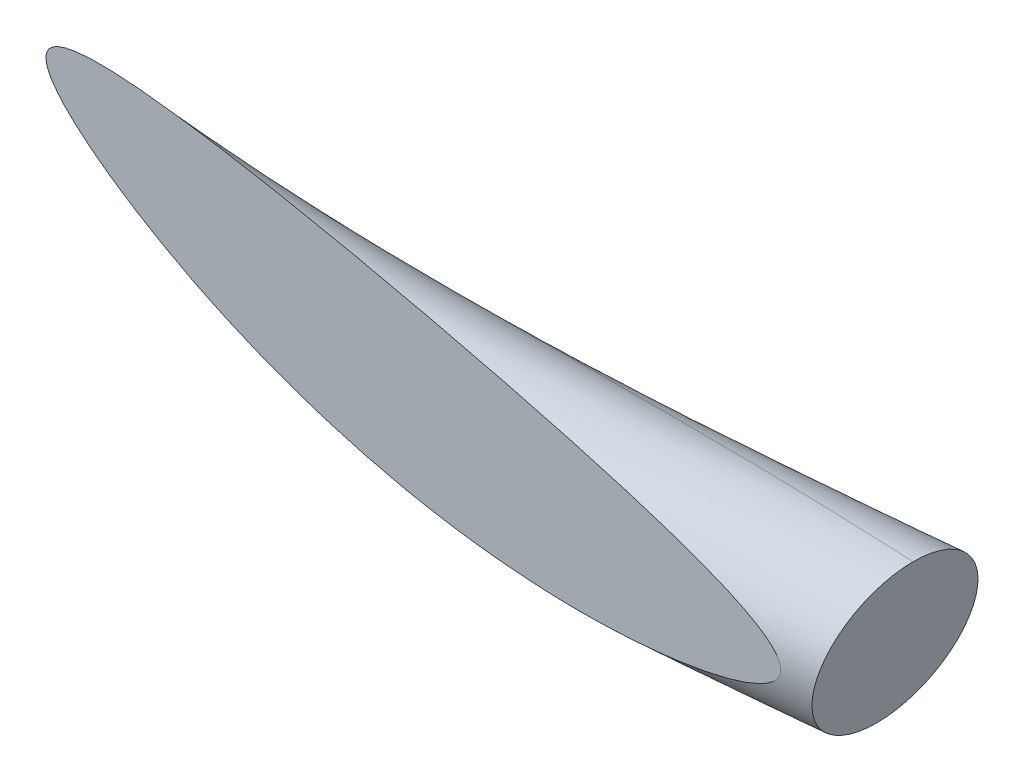
ISO-10303-21;
HEADER;
FILE_DESCRIPTION(('STEP AP214'),'2;1');
FILE_NAME('part.step','',(''),(''),'','','');
FILE_SCHEMA(('AUTOMOTIVE_DESIGN { 1 0 10303 214 1 1 1 1 }'));
ENDSEC;
DATA;
#1=APPLICATION_CONTEXT('core data for automotive mechanical design processes');
#2=APPLICATION_PROTOCOL_DEFINITION('international standard','automotive_design',2000,#1);
#3=PRODUCT_CONTEXT('',#1,'mechanical');
#4=PRODUCT('Part','Part','',(#3));
#5=PRODUCT_RELATED_PRODUCT_CATEGORY('part','',(#4));
#6=PRODUCT_DEFINITION_FORMATION('','',#4);
#7=PRODUCT_DEFINITION_CONTEXT('part definition',#1,'design');
#8=PRODUCT_DEFINITION('design','',#6,#7);
#9=PRODUCT_DEFINITION_SHAPE('','',#8);
#10=(LENGTH_UNIT() NAMED_UNIT(*) SI_UNIT(.MILLI.,.METRE.));
#11=(NAMED_UNIT(*) PLANE_ANGLE_UNIT() SI_UNIT($,.RADIAN.));
#12=(NAMED_UNIT(*) SI_UNIT($,.STERADIAN.) SOLID_ANGLE_UNIT());
#13=UNCERTAINTY_MEASURE_WITH_UNIT(LENGTH_MEASURE(1.E-05),#10,'distance_accuracy_value','');
#14=(GEOMETRIC_REPRESENTATION_CONTEXT(3) GLOBAL_UNCERTAINTY_ASSIGNED_CONTEXT((#13)) GLOBAL_UNIT_ASSIGNED_CONTEXT((#10,
#11,#12)) REPRESENTATION_CONTEXT('',''));
#15=CARTESIAN_POINT('',(0.,0.,0.));
#16=DIRECTION('',(0.,0.,1.));
#17=DIRECTION('',(1.,0.,0.));
#18=AXIS2_PLACEMENT_3D('',#15,#16,#17);
#19=CARTESIAN_POINT('',(20.629091013703,-6.16337401952087,-0.265165042944956));
#20=CARTESIAN_POINT('',(20.3127354136283,-6.14446958063098,-0.262148528351361));
#21=CARTESIAN_POINT('',(19.9975426562461,-6.12052831667255,-0.239177145228182));
#22=CARTESIAN_POINT('',(19.6823498988641,-6.09658705271414,-0.216205762105004));
#23=CARTESIAN_POINT('',(19.3699492837325,-6.06055169196005,-0.176776695296639));
#24=CARTESIAN_POINT('',(19.0575486686009,-6.02451633120597,-0.137347628488274));
#25=CARTESIAN_POINT('',(18.7491444169309,-5.97117081853297,-0.0874635959909151));
#26=CARTESIAN_POINT('',(18.440740165261,-5.91782530585997,-0.0375795634935566));
#27=CARTESIAN_POINT('',(18.1369280881539,-5.84458889985752,0.0151650429449534));
#28=CARTESIAN_POINT('',(17.8331160110468,-5.77135249385508,0.0679096493834633));
#29=CARTESIAN_POINT('',(17.5337928026547,-5.67867266131068,0.115484941563909));
#30=CARTESIAN_POINT('',(17.2344695942626,-5.58599282876628,0.163060233744356));
#31=CARTESIAN_POINT('',(16.9388485591675,-5.47727712190333,0.198223304703362));
#32=CARTESIAN_POINT('',(16.6432275240725,-5.36856141504039,0.233386375662369));
#33=CARTESIAN_POINT('',(16.3499583445323,-5.24965870258173,0.25078396660046));
#34=CARTESIAN_POINT('',(16.0566891649922,-5.13075599012307,0.268181557538551));
#35=CARTESIAN_POINT('',(15.764063474576,-5.00906602004805,0.265165042944956));
#36=CARTESIAN_POINT('',(15.47143778416,-4.88737604997303,0.262148528351361));
#37=CARTESIAN_POINT('',(15.1776492510513,-4.77072290496654,0.239177145228182));
#38=CARTESIAN_POINT('',(14.8838607179426,-4.65406975996004,0.216205762105004));
#39=CARTESIAN_POINT('',(14.5872800425834,-4.5495107117492,0.176776695296639));
#40=CARTESIAN_POINT('',(14.2906993672242,-4.44495166353838,0.137347628488274));
#41=CARTESIAN_POINT('',(13.9901223284034,-4.35770276724646,0.0874635959909153));
#42=CARTESIAN_POINT('',(13.6895452895826,-4.27045387095455,0.0375795634935567));
#43=CARTESIAN_POINT('',(13.3843760761989,-4.20309586799207,-0.0151650429449534));
#44=CARTESIAN_POINT('',(13.0792068628153,-4.1357378650296,-0.0679096493834633));
#45=CARTESIAN_POINT('',(12.7695487807166,-4.08782328860908,-0.115484941563909));
#46=CARTESIAN_POINT('',(12.4598906986179,-4.03990871218857,-0.163060233744356));
#47=CARTESIAN_POINT('',(12.1465304432222,-4.00803001008659,-0.198223304703362));
#48=CARTESIAN_POINT('',(11.8331701878265,-3.97615130798462,-0.233386375662369));
#49=CARTESIAN_POINT('',(11.5174580768759,-3.95445961147836,-0.25078396660046));
#50=CARTESIAN_POINT('',(11.2017459659253,-3.93276791497211,-0.268181557538551));
#51=CARTESIAN_POINT('',(10.8853903658506,-3.91386347608221,-0.265165042944956));
#52=CARTESIAN_POINT('',(20.6290910137029,-6.16337401952086,0.234834957055044));
#53=CARTESIAN_POINT('',(20.3351081870103,-6.04756245248583,0.237851471648639));
#54=CARTESIAN_POINT('',(20.0405851770414,-5.93409067627965,0.222762621027462));
#55=CARTESIAN_POINT('',(19.7460621670725,-5.82061890007347,0.207673770406285));
#56=CARTESIAN_POINT('',(19.4494814917133,-5.71605985186264,0.176776695296637));
#57=CARTESIAN_POINT('',(19.1529008163541,-5.61150080365181,0.14587962018699));
#58=CARTESIAN_POINT('',(18.8530582543935,-5.52107053855957,0.103878120191633));
#59=CARTESIAN_POINT('',(18.5532156924329,-5.43064027346735,0.061876620196276));
#60=CARTESIAN_POINT('',(18.2494036153258,-5.35740386746489,0.0151650429449569));
#61=CARTESIAN_POINT('',(17.9455915382187,-5.28416746146245,-0.0315465343063621));
#62=CARTESIAN_POINT('',(17.6377066401172,-5.22857238133728,-0.0758567746186321));
#63=CARTESIAN_POINT('',(17.3298217420158,-5.17297730121212,-0.120167014930902));
#64=CARTESIAN_POINT('',(17.0183807671483,-5.13278528180592,-0.155330085889909));
#65=CARTESIAN_POINT('',(16.7069397922809,-5.09259326239972,-0.190493156848915));
#66=CARTESIAN_POINT('',(16.3930008653275,-5.06322106218882,-0.211155799655182));
#67=CARTESIAN_POINT('',(16.0790619383742,-5.03384886197791,-0.231818442461448));
#68=CARTESIAN_POINT('',(15.764063474576,-5.00906602004805,-0.234834957055044));
#69=CARTESIAN_POINT('',(15.4490650107779,-4.98428317811817,-0.237851471648639));
#70=CARTESIAN_POINT('',(15.134606730256,-4.95716054535943,-0.222762621027462));
#71=CARTESIAN_POINT('',(14.8201484497342,-4.93003791260069,-0.207673770406285));
#72=CARTESIAN_POINT('',(14.5077478346026,-4.89400255184661,-0.176776695296637));
#73=CARTESIAN_POINT('',(14.195347219471,-4.85796719109252,-0.14587962018699));
#74=CARTESIAN_POINT('',(13.8862084909408,-4.80780304721983,-0.103878120191633));
#75=CARTESIAN_POINT('',(13.5770697624106,-4.75763890334717,-0.061876620196276));
#76=CARTESIAN_POINT('',(13.271900549027,-4.6902809003847,-0.0151650429449569));
#77=CARTESIAN_POINT('',(12.9667313356433,-4.62292289742223,0.0315465343063622));
#78=CARTESIAN_POINT('',(12.665634943254,-4.53792356858247,0.0758567746186323));
#79=CARTESIAN_POINT('',(12.3645385508647,-4.45292423974272,0.120167014930902));
#80=CARTESIAN_POINT('',(12.0669982352414,-4.352521850184,0.155330085889909));
#81=CARTESIAN_POINT('',(11.769457919618,-4.25211946062529,0.190493156848915));
#82=CARTESIAN_POINT('',(11.4744155560806,-4.14089725187127,0.211155799655182));
#83=CARTESIAN_POINT('',(11.1793731925432,-4.02967504311727,0.231818442461448));
#84=CARTESIAN_POINT('',(10.8853903658506,-3.91386347608221,0.234834957055044));
#85=CARTESIAN_POINT('',(20.516615486531,-6.65055905191348,0.23483495705504));
#86=CARTESIAN_POINT('',(20.2226326598384,-6.53474748487845,0.337307655338465));
#87=CARTESIAN_POINT('',(19.9366713395788,-6.38419095625303,0.414104337210003));
#88=CARTESIAN_POINT('',(19.6507100193193,-6.23363442762764,0.490901019081542));
#89=CARTESIAN_POINT('',(19.3699492837325,-6.06055169196006,0.530330085889908));
#90=CARTESIAN_POINT('',(19.0891885481457,-5.88746895629247,0.569759152698275));
#91=CARTESIAN_POINT('',(18.8100157335983,-5.70750817895248,0.565817886447274));
#92=CARTESIAN_POINT('',(18.5308429190509,-5.5275474016125,0.561876620196275));
#93=CARTESIAN_POINT('',(18.2494036153258,-5.35740386746491,0.515165042944956));
#94=CARTESIAN_POINT('',(17.9679643116008,-5.1872603333173,0.468453465693638));
#95=CARTESIAN_POINT('',(17.6807491609125,-5.04213474094438,0.386082991637012));
#96=CARTESIAN_POINT('',(17.3935340102242,-4.89700914857146,0.303712517580386));
#97=CARTESIAN_POINT('',(17.0979129751292,-4.78829344170852,0.198223304703367));
#98=CARTESIAN_POINT('',(16.8022919400341,-4.67957773484557,0.092734091826348));
#99=CARTESIAN_POINT('',(16.4969147027901,-4.61312078221543,-0.0198140834726338));
#100=CARTESIAN_POINT('',(16.1915374655461,-4.5466638295853,-0.132362258771616));
#101=CARTESIAN_POINT('',(15.876539001748,-4.52188098765543,-0.23483495705504));
#102=CARTESIAN_POINT('',(15.5615405379499,-4.49709814572555,-0.337307655338465));
#103=CARTESIAN_POINT('',(15.2385205677186,-4.50706026538605,-0.414104337210003));
#104=CARTESIAN_POINT('',(14.9155005974874,-4.51702238504653,-0.490901019081542));
#105=CARTESIAN_POINT('',(14.5872800425834,-4.54951071174919,-0.530330085889908));
#106=CARTESIAN_POINT('',(14.2590594876794,-4.58199903845187,-0.569759152698275));
#107=CARTESIAN_POINT('',(13.9292510117361,-4.62136540682694,-0.565817886447274));
#108=CARTESIAN_POINT('',(13.5994425357927,-4.660731775202,-0.561876620196275));
#109=CARTESIAN_POINT('',(13.271900549027,-4.69028090038468,-0.515165042944956));
#110=CARTESIAN_POINT('',(12.9443585622613,-4.71983002556736,-0.468453465693638));
#111=CARTESIAN_POINT('',(12.6225924224588,-4.72436120897538,-0.386082991637012));
#112=CARTESIAN_POINT('',(12.3008262826563,-4.72889239238338,-0.303712517580386));
#113=CARTESIAN_POINT('',(11.9874660272606,-4.69701369028141,-0.198223304703367));
#114=CARTESIAN_POINT('',(11.6741057718648,-4.66513498817944,-0.092734091826348));
#115=CARTESIAN_POINT('',(11.3705017186181,-4.59099753184465,0.0198140834726335));
#116=CARTESIAN_POINT('',(11.0668976653713,-4.51686007550988,0.132362258771615));
#117=CARTESIAN_POINT('',(10.7729148386787,-4.40104850847483,0.23483495705504));
#118=CARTESIAN_POINT('',(20.516615486531,-6.65055905191349,-0.265165042944959));
#119=CARTESIAN_POINT('',(20.2002598864563,-6.63165461302359,-0.162692344661536));
#120=CARTESIAN_POINT('',(19.8936288187836,-6.57062859664594,-0.0478354290456411));
#121=CARTESIAN_POINT('',(19.5869977511109,-6.5096025802683,0.0670214865702537));
#122=CARTESIAN_POINT('',(19.2904170757517,-6.40504353205746,0.176776695296632));
#123=CARTESIAN_POINT('',(18.9938364003925,-6.30048448384663,0.286531904023011));
#124=CARTESIAN_POINT('',(18.7061018961358,-6.15760845892587,0.374476170264727));
#125=CARTESIAN_POINT('',(18.418367391879,-6.01473243400512,0.462420436506442));
#126=CARTESIAN_POINT('',(18.1369280881539,-5.84458889985752,0.515165042944953));
#127=CARTESIAN_POINT('',(17.8554887844288,-5.67444536570993,0.567909649383464));
#128=CARTESIAN_POINT('',(17.5768353234499,-5.49223502091778,0.577424707819554));
#129=CARTESIAN_POINT('',(17.298181862471,-5.31002467612562,0.586939766255644));
#130=CARTESIAN_POINT('',(17.0183807671484,-5.13278528180593,0.551776695296638));
#131=CARTESIAN_POINT('',(16.7385796718257,-4.95554588748623,0.516613624337633));
#132=CARTESIAN_POINT('',(16.4538721819949,-4.79955842260835,0.442125682783008));
#133=CARTESIAN_POINT('',(16.1691646921641,-4.64357095773046,0.367637741228384));
#134=CARTESIAN_POINT('',(15.876539001748,-4.52188098765543,0.265165042944959));
#135=CARTESIAN_POINT('',(15.5839133113319,-4.40019101758041,0.162692344661536));
#136=CARTESIAN_POINT('',(15.2815630885138,-4.32062262499314,0.0478354290456411));
#137=CARTESIAN_POINT('',(14.9792128656958,-4.24105423240588,-0.0670214865702536));
#138=CARTESIAN_POINT('',(14.6668122505642,-4.20501887165179,-0.176776695296632));
#139=CARTESIAN_POINT('',(14.3544116354327,-4.16898351089772,-0.286531904023011));
#140=CARTESIAN_POINT('',(14.0331648491986,-4.17126512685355,-0.374476170264727));
#141=CARTESIAN_POINT('',(13.7119180629646,-4.1735467428094,-0.462420436506442));
#142=CARTESIAN_POINT('',(13.3843760761989,-4.20309586799207,-0.515165042944953));
#143=CARTESIAN_POINT('',(13.0568340894332,-4.23264499317476,-0.567909649383464));
#144=CARTESIAN_POINT('',(12.7265062599214,-4.27426092900198,-0.577424707819554));
#145=CARTESIAN_POINT('',(12.3961784304095,-4.31587686482922,-0.586939766255644));
#146=CARTESIAN_POINT('',(12.0669982352414,-4.352521850184,-0.551776695296638));
#147=CARTESIAN_POINT('',(11.7378180400733,-4.38916683553879,-0.516613624337633));
#148=CARTESIAN_POINT('',(11.4135442394133,-4.40455989145175,-0.442125682783009));
#149=CARTESIAN_POINT('',(11.0892704387534,-4.41995294736473,-0.367637741228384));
#150=CARTESIAN_POINT('',(10.7729148386787,-4.40104850847483,-0.265165042944959));
#151=(BOUNDED_SURFACE() B_SPLINE_SURFACE(3,2,((#19,#20,#21,#22,#23,#24,#25,#26,#27,#28,#29,#30,
#31,#32,#33,#34,#35,#36,#37,#38,#39,#40,#41,#42,#43,#44,#45,#46,#47,#48,#49,#50,#51),(#52,#53,
#54,#55,#56,#57,#58,#59,#60,#61,#62,#63,#64,#65,#66,#67,#68,#69,#70,#71,#72,#73,#74,#75,#76,#77,
#78,#79,#80,#81,#82,#83,#84),(#85,#86,#87,#88,#89,#90,#91,#92,#93,#94,#95,#96,#97,#98,#99,#100,
#101,#102,#103,#104,#105,#106,#107,#108,#109,#110,#111,#112,#113,#114,#115,#116,#117),(#118,
#119,#120,#121,#122,#123,#124,#125,#126,#127,#128,#129,#130,#131,#132,#133,#134,#135,#136,#137,
#138,#139,#140,#141,#142,#143,#144,#145,#146,#147,#148,#149,#150)),.UNSPECIFIED.,.F.,.F.,
.F.) B_SPLINE_SURFACE_WITH_KNOTS((4,4),(3,2,2,2,2,2,2,2,2,2,2,2,2,2,2,2,3),(0.5,1.),(0.,0.0625,
0.125,0.1875,0.25,0.3125,0.375,0.4375,0.5,0.5625,0.625,0.6875,0.75,0.8125,0.875,0.9375,1.),
.UNSPECIFIED.) GEOMETRIC_REPRESENTATION_ITEM() RATIONAL_B_SPLINE_SURFACE(((1.,0.98078528040323,
1.,0.98078528040323,1.,0.98078528040323,1.,0.98078528040323,1.,0.98078528040323,1.,
0.98078528040323,1.,0.98078528040323,1.,0.98078528040323,1.,0.98078528040323,1.,
0.98078528040323,1.,0.98078528040323,1.,0.98078528040323,1.,0.98078528040323,1.,
0.98078528040323,1.,0.98078528040323,1.,0.98078528040323,1.),(0.333333333333334,
0.326928426801077,0.333333333333334,0.326928426801077,0.333333333333334,0.326928426801077,
0.333333333333334,0.326928426801077,0.333333333333334,0.326928426801077,0.333333333333334,
0.326928426801077,0.333333333333334,0.326928426801077,0.333333333333334,0.326928426801077,
0.333333333333334,0.326928426801077,0.333333333333334,0.326928426801077,0.333333333333334,
0.326928426801077,0.333333333333334,0.326928426801077,0.333333333333334,0.326928426801077,
0.333333333333334,0.326928426801077,0.333333333333334,0.326928426801077,0.333333333333334,
0.326928426801077,0.333333333333334),(0.333333333333334,0.326928426801077,0.333333333333334,
0.326928426801077,0.333333333333334,0.326928426801077,0.333333333333334,0.326928426801077,
0.333333333333334,0.326928426801077,0.333333333333334,0.326928426801077,0.333333333333334,
0.326928426801077,0.333333333333334,0.326928426801077,0.333333333333334,0.326928426801077,
0.333333333333334,0.326928426801077,0.333333333333334,0.326928426801077,0.333333333333334,
0.326928426801077,0.333333333333334,0.326928426801077,0.333333333333334,0.326928426801077,
0.333333333333334,0.326928426801077,0.333333333333334,0.326928426801077,0.333333333333334),(1.,
0.98078528040323,1.,0.98078528040323,1.,0.98078528040323,1.,0.98078528040323,1.,
0.98078528040323,1.,0.98078528040323,1.,0.98078528040323,1.,0.98078528040323,1.,
0.98078528040323,1.,0.98078528040323,1.,0.98078528040323,1.,0.98078528040323,1.,
0.98078528040323,1.,0.98078528040323,1.,0.98078528040323,1.,0.98078528040323,1.))) REPRESENTATION_ITEM('') SURFACE());
#152=CARTESIAN_POINT('',(19.7657635018325,-6.5431386126793,0.));
#153=CARTESIAN_POINT('',(19.7856712928875,-6.54396982380762,0.));
#154=CARTESIAN_POINT('',(19.8055896295233,-6.54456318798323,0.));
#155=CARTESIAN_POINT('',(19.8454325002929,-6.54525613188267,0.));
#156=CARTESIAN_POINT('',(19.8653570334371,-6.5453557689975,0.));
#157=CARTESIAN_POINT('',(19.9052559509131,-6.54504294716052,0.));
#158=CARTESIAN_POINT('',(19.9252303242374,-6.54462910167178,0.));
#159=CARTESIAN_POINT('',(19.965163530822,-6.54333587178072,0.));
#160=CARTESIAN_POINT('',(19.9851223640899,-6.54245648761099,0.));
#161=CARTESIAN_POINT('',(20.0452606513832,-6.53904351895754,0.));
#162=CARTESIAN_POINT('',(20.0853987595895,-6.53573690529181,0.));
#163=CARTESIAN_POINT('',(20.1653757993071,-6.52669650939841,0.));
#164=CARTESIAN_POINT('',(20.2052150344747,-6.52096567393534,0.));
#165=CARTESIAN_POINT('',(20.2614695555628,-6.51031256374244,0.));
#166=CARTESIAN_POINT('',(20.2781567652978,-6.50682657393397,0.));
#167=CARTESIAN_POINT('',(20.3113415500428,-6.49904366573707,0.));
#168=CARTESIAN_POINT('',(20.3278391945265,-6.49474705518731,0.));
#169=CARTESIAN_POINT('',(20.3592091129596,-6.48542127681081,0.));
#170=CARTESIAN_POINT('',(20.3741066738883,-6.48047701932929,0.));
#171=CARTESIAN_POINT('',(20.4034374775021,-6.46917582609198,0.));
#172=CARTESIAN_POINT('',(20.4178699265963,-6.46281660851198,0.));
#173=CARTESIAN_POINT('',(20.4385586842128,-6.45134082791128,0.));
#174=CARTESIAN_POINT('',(20.445326567518,-6.44716674266135,0.));
#175=CARTESIAN_POINT('',(20.4581461431644,-6.43786911892822,0.));
#176=CARTESIAN_POINT('',(20.4642031331309,-6.43275344528898,0.));
#177=CARTESIAN_POINT('',(20.4734610795265,-6.42257721222107,0.));
#178=CARTESIAN_POINT('',(20.4769960569676,-6.41783958255583,0.));
#179=CARTESIAN_POINT('',(20.4824265981168,-6.40733753939651,0.));
#180=CARTESIAN_POINT('',(20.4843058275141,-6.40156355748327,0.));
#181=CARTESIAN_POINT('',(20.485394337606,-6.39042585224517,0.));
#182=CARTESIAN_POINT('',(20.4848821496545,-6.3850898265047,-2.86986976378911E-13));
#183=CARTESIAN_POINT('',(20.4818804645482,-6.37355886644759,-3.4152470787184E-13));
#184=CARTESIAN_POINT('',(20.4789043871295,-6.36750938767171,0.));
#185=CARTESIAN_POINT('',(20.4720111990254,-6.35684059661074,0.));
#186=CARTESIAN_POINT('',(20.4682027124092,-6.35214161069068,0.));
#187=CARTESIAN_POINT('',(20.4599858103376,-6.34328217462558,0.));
#188=CARTESIAN_POINT('',(20.4555753842175,-6.33912362466881,0.));
#189=CARTESIAN_POINT('',(20.4413965562832,-6.32688132916093,0.));
#190=CARTESIAN_POINT('',(20.43104978107,-6.31948618030233,0.));
#191=CARTESIAN_POINT('',(20.4097354770108,-6.30570906090727,0.));
#192=CARTESIAN_POINT('',(20.3987675053873,-6.29932782571869,-1.58524476480182E-13));
#193=CARTESIAN_POINT('',(20.3763730645553,-6.28717473576867,1.59936639581926E-13));
#194=CARTESIAN_POINT('',(20.3649433813409,-6.28140881585827,5.96282848450191E-13));
#195=CARTESIAN_POINT('',(20.3418728147792,-6.27035658169338,-5.95689520592345E-13));
#196=CARTESIAN_POINT('',(20.330232152902,-6.26506979591893,-2.22195409757902E-12));
#197=CARTESIAN_POINT('',(20.2955157675229,-6.24991612739802,-3.95280876247085E-12));
#198=CARTESIAN_POINT('',(20.2722255143011,-6.24054255775912,-1.08292770119105E-12));
#199=CARTESIAN_POINT('',(20.2253265309996,-6.22262357916096,1.08334865055194E-12));
#200=CARTESIAN_POINT('',(20.2017176806427,-6.21407849353584,3.78354442763802E-13));
#201=CARTESIAN_POINT('',(20.1305376717302,-6.18927369069117,-7.57637616020959E-13));
#202=CARTESIAN_POINT('',(20.082670281603,-6.17386749272624,-2.05507049098778E-13));
#203=CARTESIAN_POINT('',(19.9867793624861,-6.14444872344934,2.04489823335946E-13));
#204=CARTESIAN_POINT('',(19.9387577791497,-6.13042963138194,0.));
#205=CARTESIAN_POINT('',(19.8424752684324,-6.10337185667966,0.));
#206=CARTESIAN_POINT('',(19.7942145288523,-6.09033250489568,0.));
#207=CARTESIAN_POINT('',(19.7032841946373,-6.06645604095859,0.));
#208=CARTESIAN_POINT('',(19.6606346628916,-6.05554181720971,1.77015498307519E-13));
#209=CARTESIAN_POINT('',(19.5752136839694,-6.03416951221614,-1.77046691168191E-13));
#210=CARTESIAN_POINT('',(19.5324422166339,-6.02371151168969,-6.386316027853E-13));
#211=CARTESIAN_POINT('',(19.4039349371476,-5.99296258267913,1.27785763930881E-12));
#212=CARTESIAN_POINT('',(19.3180459164206,-5.97330705186971,6.96067858414691E-12));
#213=CARTESIAN_POINT('',(19.174586420413,-5.94198941820761,5.10978647028664E-12));
#214=CARTESIAN_POINT('',(19.1171201268729,-5.92984687064655,1.35031406880111E-12));
#215=CARTESIAN_POINT('',(19.0020078155184,-5.90646849558197,-1.35015683711631E-12));
#216=CARTESIAN_POINT('',(18.9443618194105,-5.89523256266384,-2.91716357653552E-13));
#217=CARTESIAN_POINT('',(18.8484176896091,-5.87766313655958,1.92898331366684E-13));
#218=CARTESIAN_POINT('',(18.8101876146521,-5.87095927037903,0.));
#219=CARTESIAN_POINT('',(18.7336031174744,-5.85830781865927,0.));
#220=CARTESIAN_POINT('',(18.6952487044339,-5.85236017853307,0.));
#221=CARTESIAN_POINT('',(18.6314160840678,-5.84334734911109,0.));
#222=CARTESIAN_POINT('',(18.6059795088328,-5.83998842474677,0.));
#223=CARTESIAN_POINT('',(18.555031269762,-5.83390402371545,0.));
#224=CARTESIAN_POINT('',(18.529519616548,-5.83117846143011,0.));
#225=CARTESIAN_POINT('',(18.4870196246178,-5.82742522164896,0.));
#226=CARTESIAN_POINT('',(18.4700547769046,-5.82613487260256,0.));
#227=CARTESIAN_POINT('',(18.4361002058719,-5.82412328345056,0.));
#228=CARTESIAN_POINT('',(18.4191105089835,-5.82340163741401,0.));
#229=CARTESIAN_POINT('',(18.390750754166,-5.82289894521078,0.));
#230=CARTESIAN_POINT('',(18.3793853031005,-5.82288535411399,0.));
#231=CARTESIAN_POINT('',(18.3566667993281,-5.82337658616204,0.));
#232=CARTESIAN_POINT('',(18.3453137435033,-5.82388120546118,1.06266371446569E-13));
#233=CARTESIAN_POINT('',(18.3229154925966,-5.82562728229112,-1.02744015324077E-13));
#234=CARTESIAN_POINT('',(18.3118691003632,-5.82685197230025,-3.81117001323292E-13));
#235=CARTESIAN_POINT('',(18.2899763395322,-5.83044592842413,3.79800621359439E-13));
#236=CARTESIAN_POINT('',(18.2791294118372,-5.83281122655674,1.41454333465066E-12));
#237=CARTESIAN_POINT('',(18.2602875659629,-5.83887389202885,1.23853575038291E-12));
#238=CARTESIAN_POINT('',(18.2521795086446,-5.84217729342313,4.61381159329852E-13));
#239=CARTESIAN_POINT('',(18.2390961915436,-5.85002864926089,-3.42583178774712E-13));
#240=CARTESIAN_POINT('',(18.2338482403975,-5.85404754353436,-5.09819885361749E-13));
#241=CARTESIAN_POINT('',(18.2277628434525,-5.86088481859611,2.1035665897194E-13));
#242=CARTESIAN_POINT('',(18.2261466508056,-5.86301922708488,5.35367854953749E-13));
#243=CARTESIAN_POINT('',(18.2247311923683,-5.86530453885813,1.01030413393525E-12));
#244=B_SPLINE_CURVE_WITH_KNOTS('',3,(#152,#153,#154,#155,#156,#157,#158,#159,#160,#161,#162,
#163,#164,#165,#166,#167,#168,#169,#170,#171,#172,#173,#174,#175,#176,#177,#178,#179,#180,#181,
#182,#183,#184,#185,#186,#187,#188,#189,#190,#191,#192,#193,#194,#195,#196,#197,#198,#199,#200,
#201,#202,#203,#204,#205,#206,#207,#208,#209,#210,#211,#212,#213,#214,#215,#216,#217,#218,#219,
#220,#221,#222,#223,#224,#225,#226,#227,#228,#229,#230,#231,#232,#233,#234,#235,#236,#237,#238,
#239,#240,#241,#242,#243),.UNSPECIFIED.,.F.,.F.,(4,2,2,2,2,2,2,2,2,2,2,2,2,2,2,2,2,2,2,2,2,2,2,
2,2,2,2,2,2,2,2,2,2,2,2,2,2,2,2,2,2,2,2,2,2,4),(0.,0.0597749641716232,0.119542979917802,
0.17947273670242,0.239402463544526,0.360170271952191,0.480791700895473,0.531921400133732,
0.583031721467327,0.63009624974173,0.67723723354251,0.701048800270953,0.724669825807787,
0.742227510201339,0.759956525727209,0.775675661641567,0.795547118438668,0.81363250160637,
0.831779845628505,0.869800213951864,0.907848032170209,0.946234786849238,0.984583345006292,
1.05986940265878,1.13518472506995,1.28600024319794,1.43606924955835,1.58603481119131,
1.71810401511269,1.85019649166452,2.11450439550267,2.29070535097367,2.46688578945997,
2.58332099338225,2.69974778783639,2.77671531667302,2.8536724349241,2.90470818946826,
2.95570748244207,2.98979616354018,3.02387144048675,3.05718302079725,3.09037954274841,
3.11646377087487,3.13592419867294,3.14393987694467),.UNSPECIFIED.);
#245=CARTESIAN_POINT('',(19.7657635018325,-6.5431386126793,0.));
#246=VERTEX_POINT('',#245);
#247=CARTESIAN_POINT('',(18.224731192372,-5.86530453886305,0.));
#248=VERTEX_POINT('',#247);
#249=EDGE_CURVE('E11',#246,#248,#244,.T.);
#250=CARTESIAN_POINT('',(20.516615486531,-6.65055905191349,-0.265165042944959));
#251=CARTESIAN_POINT('',(20.2002598864563,-6.63165461302359,-0.162692344661536));
#252=CARTESIAN_POINT('',(19.8936288187836,-6.57062859664594,-0.0478354290456411));
#253=CARTESIAN_POINT('',(19.5869977511109,-6.5096025802683,0.0670214865702537));
#254=CARTESIAN_POINT('',(19.2904170757517,-6.40504353205746,0.176776695296632));
#255=CARTESIAN_POINT('',(18.9938364003925,-6.30048448384663,0.286531904023011));
#256=CARTESIAN_POINT('',(18.7061018961358,-6.15760845892587,0.374476170264727));
#257=CARTESIAN_POINT('',(18.418367391879,-6.01473243400512,0.462420436506442));
#258=CARTESIAN_POINT('',(18.1369280881539,-5.84458889985752,0.515165042944953));
#259=CARTESIAN_POINT('',(17.8554887844288,-5.67444536570993,0.567909649383464));
#260=CARTESIAN_POINT('',(17.5768353234499,-5.49223502091778,0.577424707819554));
#261=CARTESIAN_POINT('',(17.298181862471,-5.31002467612562,0.586939766255644));
#262=CARTESIAN_POINT('',(17.0183807671484,-5.13278528180593,0.551776695296638));
#263=CARTESIAN_POINT('',(16.7385796718257,-4.95554588748623,0.516613624337633));
#264=CARTESIAN_POINT('',(16.4538721819949,-4.79955842260835,0.442125682783008));
#265=CARTESIAN_POINT('',(16.1691646921641,-4.64357095773046,0.367637741228384));
#266=CARTESIAN_POINT('',(15.876539001748,-4.52188098765543,0.265165042944959));
#267=CARTESIAN_POINT('',(15.5839133113319,-4.40019101758041,0.162692344661536));
#268=CARTESIAN_POINT('',(15.2815630885138,-4.32062262499314,0.0478354290456411));
#269=CARTESIAN_POINT('',(14.9792128656958,-4.24105423240588,-0.0670214865702536));
#270=CARTESIAN_POINT('',(14.6668122505642,-4.20501887165179,-0.176776695296632));
#271=CARTESIAN_POINT('',(14.3544116354327,-4.16898351089772,-0.286531904023011));
#272=CARTESIAN_POINT('',(14.0331648491986,-4.17126512685355,-0.374476170264727));
#273=CARTESIAN_POINT('',(13.7119180629646,-4.1735467428094,-0.462420436506442));
#274=CARTESIAN_POINT('',(13.3843760761989,-4.20309586799207,-0.515165042944953));
#275=CARTESIAN_POINT('',(13.0568340894332,-4.23264499317476,-0.567909649383464));
#276=CARTESIAN_POINT('',(12.7265062599214,-4.27426092900198,-0.577424707819554));
#277=CARTESIAN_POINT('',(12.3961784304095,-4.31587686482922,-0.586939766255644));
#278=CARTESIAN_POINT('',(12.0669982352414,-4.352521850184,-0.551776695296638));
#279=CARTESIAN_POINT('',(11.7378180400733,-4.38916683553879,-0.516613624337633));
#280=CARTESIAN_POINT('',(11.4135442394133,-4.40455989145175,-0.442125682783009));
#281=CARTESIAN_POINT('',(11.0892704387534,-4.41995294736473,-0.367637741228384));
#282=CARTESIAN_POINT('',(10.7729148386787,-4.40104850847483,-0.265165042944959));
#283=(BOUNDED_CURVE() B_SPLINE_CURVE(2,(#250,#251,#252,#253,#254,#255,#256,#257,#258,#259,#260,
#261,#262,#263,#264,#265,#266,#267,#268,#269,#270,#271,#272,#273,#274,#275,#276,#277,#278,#279,
#280,#281,#282),.UNSPECIFIED.,.F.,.F.) B_SPLINE_CURVE_WITH_KNOTS((3,2,2,2,2,2,2,2,2,2,2,2,2,2,2,
2,3),(0.,0.0625,0.125,0.1875,0.25,0.3125,0.375,0.4375,0.5,0.5625,0.625,0.6875,0.75,0.8125,0.875,
0.9375,1.),.UNSPECIFIED.) CURVE() GEOMETRIC_REPRESENTATION_ITEM() RATIONAL_B_SPLINE_CURVE((1.,
0.98078528040323,1.,0.98078528040323,1.,0.98078528040323,1.,0.98078528040323,1.,
0.98078528040323,1.,0.98078528040323,1.,0.98078528040323,1.,0.98078528040323,1.,
0.98078528040323,1.,0.98078528040323,1.,0.98078528040323,1.,0.98078528040323,1.,
0.98078528040323,1.,0.98078528040323,1.,0.98078528040323,1.,0.98078528040323,1.)) REPRESENTATION_ITEM(''));
#284=CARTESIAN_POINT('',(20.516615486531,-6.65055905191349,-0.265165042944959));
#285=VERTEX_POINT('',#284);
#286=EDGE_CURVE('E52',#285,#246,#283,.T.);
#287=CARTESIAN_POINT('',(20.572853250117,-6.40696653571718,-0.265165042944958));
#288=DIRECTION('',(0.974370064785235,-0.224951054343864,0.));
#289=DIRECTION('',(-0.224951054343864,-0.974370064785236,0.));
#290=AXIS2_PLACEMENT_3D('',#287,#288,#289);
#291=CIRCLE('',#290,0.25);
#292=CARTESIAN_POINT('',(20.629091013703,-6.16337401952087,-0.265165042944956));
#293=VERTEX_POINT('',#292);
#294=EDGE_CURVE('E82',#293,#285,#291,.T.);
#295=CARTESIAN_POINT('',(20.629091013703,-6.16337401952087,-0.265165042944956));
#296=CARTESIAN_POINT('',(20.3127354136283,-6.14446958063098,-0.262148528351361));
#297=CARTESIAN_POINT('',(19.9975426562461,-6.12052831667255,-0.239177145228182));
#298=CARTESIAN_POINT('',(19.6823498988641,-6.09658705271414,-0.216205762105004));
#299=CARTESIAN_POINT('',(19.3699492837325,-6.06055169196005,-0.176776695296639));
#300=CARTESIAN_POINT('',(19.0575486686009,-6.02451633120597,-0.137347628488274));
#301=CARTESIAN_POINT('',(18.7491444169309,-5.97117081853297,-0.0874635959909151));
#302=CARTESIAN_POINT('',(18.440740165261,-5.91782530585997,-0.0375795634935566));
#303=CARTESIAN_POINT('',(18.1369280881539,-5.84458889985752,0.0151650429449534));
#304=CARTESIAN_POINT('',(17.8331160110468,-5.77135249385508,0.0679096493834633));
#305=CARTESIAN_POINT('',(17.5337928026547,-5.67867266131068,0.115484941563909));
#306=CARTESIAN_POINT('',(17.2344695942626,-5.58599282876628,0.163060233744356));
#307=CARTESIAN_POINT('',(16.9388485591675,-5.47727712190333,0.198223304703362));
#308=CARTESIAN_POINT('',(16.6432275240725,-5.36856141504039,0.233386375662369));
#309=CARTESIAN_POINT('',(16.3499583445323,-5.24965870258173,0.25078396660046));
#310=CARTESIAN_POINT('',(16.0566891649922,-5.13075599012307,0.268181557538551));
#311=CARTESIAN_POINT('',(15.764063474576,-5.00906602004805,0.265165042944956));
#312=CARTESIAN_POINT('',(15.47143778416,-4.88737604997303,0.262148528351361));
#313=CARTESIAN_POINT('',(15.1776492510513,-4.77072290496654,0.239177145228182));
#314=CARTESIAN_POINT('',(14.8838607179426,-4.65406975996004,0.216205762105004));
#315=CARTESIAN_POINT('',(14.5872800425834,-4.5495107117492,0.176776695296639));
#316=CARTESIAN_POINT('',(14.2906993672242,-4.44495166353838,0.137347628488274));
#317=CARTESIAN_POINT('',(13.9901223284034,-4.35770276724646,0.0874635959909153));
#318=CARTESIAN_POINT('',(13.6895452895826,-4.27045387095455,0.0375795634935567));
#319=CARTESIAN_POINT('',(13.3843760761989,-4.20309586799207,-0.0151650429449534));
#320=CARTESIAN_POINT('',(13.0792068628153,-4.1357378650296,-0.0679096493834633));
#321=CARTESIAN_POINT('',(12.7695487807166,-4.08782328860908,-0.115484941563909));
#322=CARTESIAN_POINT('',(12.4598906986179,-4.03990871218857,-0.163060233744356));
#323=CARTESIAN_POINT('',(12.1465304432222,-4.00803001008659,-0.198223304703362));
#324=CARTESIAN_POINT('',(11.8331701878265,-3.97615130798462,-0.233386375662369));
#325=CARTESIAN_POINT('',(11.5174580768759,-3.95445961147836,-0.25078396660046));
#326=CARTESIAN_POINT('',(11.2017459659253,-3.93276791497211,-0.268181557538551));
#327=CARTESIAN_POINT('',(10.8853903658506,-3.91386347608221,-0.265165042944956));
#328=(BOUNDED_CURVE() B_SPLINE_CURVE(2,(#295,#296,#297,#298,#299,#300,#301,#302,#303,#304,#305,
#306,#307,#308,#309,#310,#311,#312,#313,#314,#315,#316,#317,#318,#319,#320,#321,#322,#323,#324,
#325,#326,#327),.UNSPECIFIED.,.F.,.F.) B_SPLINE_CURVE_WITH_KNOTS((3,2,2,2,2,2,2,2,2,2,2,2,2,2,2,
2,3),(0.,0.0625,0.125,0.1875,0.25,0.3125,0.375,0.4375,0.5,0.5625,0.625,0.6875,0.75,0.8125,0.875,
0.9375,1.),.UNSPECIFIED.) CURVE() GEOMETRIC_REPRESENTATION_ITEM() RATIONAL_B_SPLINE_CURVE((1.,
0.98078528040323,1.,0.98078528040323,1.,0.98078528040323,1.,0.98078528040323,1.,
0.98078528040323,1.,0.98078528040323,1.,0.98078528040323,1.,0.98078528040323,1.,
0.98078528040323,1.,0.98078528040323,1.,0.98078528040323,1.,0.98078528040323,1.,
0.98078528040323,1.,0.98078528040323,1.,0.98078528040323,1.,0.98078528040323,1.)) REPRESENTATION_ITEM(''));
#329=EDGE_CURVE('E85',#293,#248,#328,.T.);
#330=ORIENTED_EDGE('',*,*,#249,.F.);
#331=ORIENTED_EDGE('',*,*,#286,.F.);
#332=ORIENTED_EDGE('',*,*,#294,.F.);
#333=ORIENTED_EDGE('',*,*,#329,.T.);
#334=EDGE_LOOP('',(#330,#331,#332,#333));
#335=FACE_BOUND('',#334,.T.);
#336=ADVANCED_FACE('F46',(#335),#151,.F.);
#337=CARTESIAN_POINT('',(20.516615486531,-6.65055905191349,-0.265165042944959));
#338=CARTESIAN_POINT('',(20.2002598864563,-6.63165461302359,-0.162692344661536));
#339=CARTESIAN_POINT('',(19.8936288187836,-6.57062859664594,-0.0478354290456411));
#340=CARTESIAN_POINT('',(19.5869977511109,-6.5096025802683,0.0670214865702537));
#341=CARTESIAN_POINT('',(19.2904170757517,-6.40504353205746,0.176776695296632));
#342=CARTESIAN_POINT('',(18.9938364003925,-6.30048448384663,0.286531904023011));
#343=CARTESIAN_POINT('',(18.7061018961358,-6.15760845892587,0.374476170264727));
#344=CARTESIAN_POINT('',(18.418367391879,-6.01473243400512,0.462420436506442));
#345=CARTESIAN_POINT('',(18.1369280881539,-5.84458889985752,0.515165042944953));
#346=CARTESIAN_POINT('',(17.8554887844288,-5.67444536570993,0.567909649383464));
#347=CARTESIAN_POINT('',(17.5768353234499,-5.49223502091778,0.577424707819554));
#348=CARTESIAN_POINT('',(17.298181862471,-5.31002467612562,0.586939766255644));
#349=CARTESIAN_POINT('',(17.0183807671484,-5.13278528180593,0.551776695296638));
#350=CARTESIAN_POINT('',(16.7385796718257,-4.95554588748623,0.516613624337633));
#351=CARTESIAN_POINT('',(16.4538721819949,-4.79955842260835,0.442125682783008));
#352=CARTESIAN_POINT('',(16.1691646921641,-4.64357095773046,0.367637741228384));
#353=CARTESIAN_POINT('',(15.876539001748,-4.52188098765543,0.265165042944959));
#354=CARTESIAN_POINT('',(15.5839133113319,-4.40019101758041,0.162692344661536));
#355=CARTESIAN_POINT('',(15.2815630885138,-4.32062262499314,0.0478354290456411));
#356=CARTESIAN_POINT('',(14.9792128656958,-4.24105423240588,-0.0670214865702536));
#357=CARTESIAN_POINT('',(14.6668122505642,-4.20501887165179,-0.176776695296632));
#358=CARTESIAN_POINT('',(14.3544116354327,-4.16898351089772,-0.286531904023011));
#359=CARTESIAN_POINT('',(14.0331648491986,-4.17126512685355,-0.374476170264727));
#360=CARTESIAN_POINT('',(13.7119180629646,-4.1735467428094,-0.462420436506442));
#361=CARTESIAN_POINT('',(13.3843760761989,-4.20309586799207,-0.515165042944953));
#362=CARTESIAN_POINT('',(13.0568340894332,-4.23264499317476,-0.567909649383464));
#363=CARTESIAN_POINT('',(12.7265062599214,-4.27426092900198,-0.577424707819554));
#364=CARTESIAN_POINT('',(12.3961784304095,-4.31587686482922,-0.586939766255644));
#365=CARTESIAN_POINT('',(12.0669982352414,-4.352521850184,-0.551776695296638));
#366=CARTESIAN_POINT('',(11.7378180400733,-4.38916683553879,-0.516613624337633));
#367=CARTESIAN_POINT('',(11.4135442394133,-4.40455989145175,-0.442125682783009));
#368=CARTESIAN_POINT('',(11.0892704387534,-4.41995294736473,-0.367637741228384));
#369=CARTESIAN_POINT('',(10.7729148386787,-4.40104850847483,-0.265165042944959));
#370=CARTESIAN_POINT('',(20.516615486531,-6.65055905191348,-0.765165042944959));
#371=CARTESIAN_POINT('',(20.1778871130743,-6.72856174116874,-0.662692344661536));
#372=CARTESIAN_POINT('',(19.8505862979884,-6.75706623703883,-0.509775195301285));
#373=CARTESIAN_POINT('',(19.5232854829025,-6.78557073290894,-0.356858045941035));
#374=CARTESIAN_POINT('',(19.2108848677709,-6.74953537215486,-0.176776695296644));
#375=CARTESIAN_POINT('',(18.8984842526393,-6.71350001140078,0.00330465534774707));
#376=CARTESIAN_POINT('',(18.6021880586732,-6.60770873889925,0.183134454082178));
#377=CARTESIAN_POINT('',(18.305891864707,-6.50191746639773,0.36296425281661));
#378=CARTESIAN_POINT('',(18.024452560982,-6.33177393225013,0.51516504294495));
#379=CARTESIAN_POINT('',(17.7430132572569,-6.16163039810255,0.667365833073289));
#380=CARTESIAN_POINT('',(17.4729214859874,-5.94233530089117,0.768766424002094));
#381=CARTESIAN_POINT('',(17.2028297147178,-5.72304020367978,0.870167014930902));
#382=CARTESIAN_POINT('',(16.9388485591675,-5.47727712190333,0.905330085889909));
#383=CARTESIAN_POINT('',(16.6748674036173,-5.23151404012689,0.940493156848917));
#384=CARTESIAN_POINT('',(16.4108296611997,-4.98599606300125,0.904065449038649));
#385=CARTESIAN_POINT('',(16.146791918782,-4.74047808587561,0.867637741228382));
#386=CARTESIAN_POINT('',(15.876539001748,-4.52188098765543,0.765165042944959));
#387=CARTESIAN_POINT('',(15.6062860847139,-4.30328388943526,0.662692344661536));
#388=CARTESIAN_POINT('',(15.3246056093091,-4.13418498460024,0.509775195301285));
#389=CARTESIAN_POINT('',(15.0429251339042,-3.96508607976522,0.356858045941035));
#390=CARTESIAN_POINT('',(14.746344458545,-3.86052703155438,0.176776695296644));
#391=CARTESIAN_POINT('',(14.4497637831858,-3.75596798334355,-0.00330465534774718));
#392=CARTESIAN_POINT('',(14.1370786866612,-3.72116484688016,-0.183134454082178));
#393=CARTESIAN_POINT('',(13.8243935901366,-3.68636171041677,-0.362964252816609));
#394=CARTESIAN_POINT('',(13.4968516033709,-3.71591083559946,-0.51516504294495));
#395=CARTESIAN_POINT('',(13.1693096166051,-3.74545996078213,-0.667365833073289));
#396=CARTESIAN_POINT('',(12.8304200973839,-3.8241606490286,-0.768766424002094));
#397=CARTESIAN_POINT('',(12.4915305781627,-3.90286133727506,-0.870167014930902));
#398=CARTESIAN_POINT('',(12.1465304432222,-4.00803001008659,-0.905330085889909));
#399=CARTESIAN_POINT('',(11.8015303082817,-4.11319868289812,-0.940493156848917));
#400=CARTESIAN_POINT('',(11.4565867602085,-4.21812225105885,-0.904065449038649));
#401=CARTESIAN_POINT('',(11.1116432121354,-4.32304581921957,-0.867637741228382));
#402=CARTESIAN_POINT('',(10.7729148386787,-4.40104850847483,-0.765165042944959));
#403=CARTESIAN_POINT('',(20.6290910137029,-6.16337401952086,-0.765165042944956));
#404=CARTESIAN_POINT('',(20.2903626402462,-6.24137670877612,-0.762148528351361));
#405=CARTESIAN_POINT('',(19.9545001354509,-6.30696595706545,-0.701116911483828));
#406=CARTESIAN_POINT('',(19.6186376306557,-6.37255520535479,-0.640085294616293));
#407=CARTESIAN_POINT('',(19.2904170757517,-6.40504353205746,-0.530330085889915));
#408=CARTESIAN_POINT('',(18.9621965208477,-6.43753185876012,-0.420574877163537));
#409=CARTESIAN_POINT('',(18.6452305794684,-6.42127109850636,-0.278805312173463));
#410=CARTESIAN_POINT('',(18.3282646380891,-6.40501033825258,-0.137035747183389));
#411=CARTESIAN_POINT('',(18.024452560982,-6.33177393225013,0.0151650429449499));
#412=CARTESIAN_POINT('',(17.7206404838748,-6.25853752624769,0.167365833073289));
#413=CARTESIAN_POINT('',(17.4298789651921,-6.12877294128406,0.30682665774645));
#414=CARTESIAN_POINT('',(17.1391174465094,-5.99900835632044,0.446287482419612));
#415=CARTESIAN_POINT('',(16.8593163511867,-5.82176896200075,0.551776695296634));
#416=CARTESIAN_POINT('',(16.5795152558641,-5.64452956768104,0.657265908173653));
#417=CARTESIAN_POINT('',(16.3069158237371,-5.43609634297464,0.712723732856101));
#418=CARTESIAN_POINT('',(16.0343163916101,-5.22766311826823,0.768181557538549));
#419=CARTESIAN_POINT('',(15.764063474576,-5.00906602004805,0.765165042944956));
#420=CARTESIAN_POINT('',(15.493810557542,-4.79046892182788,0.762148528351361));
#421=CARTESIAN_POINT('',(15.2206917718465,-4.58428526457363,0.701116911483828));
#422=CARTESIAN_POINT('',(14.947572986151,-4.37810160731938,0.640085294616293));
#423=CARTESIAN_POINT('',(14.6668122505642,-4.2050188716518,0.530330085889915));
#424=CARTESIAN_POINT('',(14.3860515149774,-4.03193613598421,0.420574877163537));
#425=CARTESIAN_POINT('',(14.094036165866,-3.90760248727307,0.278805312173463));
#426=CARTESIAN_POINT('',(13.8020208167545,-3.78326883856193,0.137035747183389));
#427=CARTESIAN_POINT('',(13.4968516033709,-3.71591083559946,-0.0151650429449498));
#428=CARTESIAN_POINT('',(13.1916823899872,-3.64855283263698,-0.167365833073289));
#429=CARTESIAN_POINT('',(12.8734626181792,-3.6377230086357,-0.306826657746451));
#430=CARTESIAN_POINT('',(12.5552428463711,-3.6268931846344,-0.446287482419612));
#431=CARTESIAN_POINT('',(12.226062651203,-3.66353816998919,-0.551776695296634));
#432=CARTESIAN_POINT('',(11.8968824560349,-3.70018315534397,-0.657265908173653));
#433=CARTESIAN_POINT('',(11.5605005976711,-3.76802197108546,-0.712723732856101));
#434=CARTESIAN_POINT('',(11.2241187393073,-3.83586078682696,-0.768181557538549));
#435=CARTESIAN_POINT('',(10.8853903658506,-3.91386347608221,-0.765165042944956));
#436=CARTESIAN_POINT('',(20.629091013703,-6.16337401952087,-0.265165042944956));
#437=CARTESIAN_POINT('',(20.3127354136283,-6.14446958063098,-0.262148528351361));
#438=CARTESIAN_POINT('',(19.9975426562461,-6.12052831667255,-0.239177145228182));
#439=CARTESIAN_POINT('',(19.6823498988641,-6.09658705271414,-0.216205762105004));
#440=CARTESIAN_POINT('',(19.3699492837325,-6.06055169196005,-0.176776695296639));
#441=CARTESIAN_POINT('',(19.0575486686009,-6.02451633120597,-0.137347628488274));
#442=CARTESIAN_POINT('',(18.7491444169309,-5.97117081853297,-0.0874635959909151));
#443=CARTESIAN_POINT('',(18.440740165261,-5.91782530585997,-0.0375795634935566));
#444=CARTESIAN_POINT('',(18.1369280881539,-5.84458889985752,0.0151650429449534));
#445=CARTESIAN_POINT('',(17.8331160110468,-5.77135249385508,0.0679096493834633));
#446=CARTESIAN_POINT('',(17.5337928026547,-5.67867266131068,0.115484941563909));
#447=CARTESIAN_POINT('',(17.2344695942626,-5.58599282876628,0.163060233744356));
#448=CARTESIAN_POINT('',(16.9388485591675,-5.47727712190333,0.198223304703362));
#449=CARTESIAN_POINT('',(16.6432275240725,-5.36856141504039,0.233386375662369));
#450=CARTESIAN_POINT('',(16.3499583445323,-5.24965870258173,0.25078396660046));
#451=CARTESIAN_POINT('',(16.0566891649922,-5.13075599012307,0.268181557538551));
#452=CARTESIAN_POINT('',(15.764063474576,-5.00906602004805,0.265165042944956));
#453=CARTESIAN_POINT('',(15.47143778416,-4.88737604997303,0.262148528351361));
#454=CARTESIAN_POINT('',(15.1776492510513,-4.77072290496654,0.239177145228182));
#455=CARTESIAN_POINT('',(14.8838607179426,-4.65406975996004,0.216205762105004));
#456=CARTESIAN_POINT('',(14.5872800425834,-4.5495107117492,0.176776695296639));
#457=CARTESIAN_POINT('',(14.2906993672242,-4.44495166353838,0.137347628488274));
#458=CARTESIAN_POINT('',(13.9901223284034,-4.35770276724646,0.0874635959909153));
#459=CARTESIAN_POINT('',(13.6895452895826,-4.27045387095455,0.0375795634935567));
#460=CARTESIAN_POINT('',(13.3843760761989,-4.20309586799207,-0.0151650429449534));
#461=CARTESIAN_POINT('',(13.0792068628153,-4.1357378650296,-0.0679096493834633));
#462=CARTESIAN_POINT('',(12.7695487807166,-4.08782328860908,-0.115484941563909));
#463=CARTESIAN_POINT('',(12.4598906986179,-4.03990871218857,-0.163060233744356));
#464=CARTESIAN_POINT('',(12.1465304432222,-4.00803001008659,-0.198223304703362));
#465=CARTESIAN_POINT('',(11.8331701878265,-3.97615130798462,-0.233386375662369));
#466=CARTESIAN_POINT('',(11.5174580768759,-3.95445961147836,-0.25078396660046));
#467=CARTESIAN_POINT('',(11.2017459659253,-3.93276791497211,-0.268181557538551));
#468=CARTESIAN_POINT('',(10.8853903658506,-3.91386347608221,-0.265165042944956));
#469=(BOUNDED_SURFACE() B_SPLINE_SURFACE(3,2,((#337,#338,#339,#340,#341,#342,#343,#344,#345,
#346,#347,#348,#349,#350,#351,#352,#353,#354,#355,#356,#357,#358,#359,#360,#361,#362,#363,#364,
#365,#366,#367,#368,#369),(#370,#371,#372,#373,#374,#375,#376,#377,#378,#379,#380,#381,#382,
#383,#384,#385,#386,#387,#388,#389,#390,#391,#392,#393,#394,#395,#396,#397,#398,#399,#400,#401,
#402),(#403,#404,#405,#406,#407,#408,#409,#410,#411,#412,#413,#414,#415,#416,#417,#418,#419,
#420,#421,#422,#423,#424,#425,#426,#427,#428,#429,#430,#431,#432,#433,#434,#435),(#436,#437,
#438,#439,#440,#441,#442,#443,#444,#445,#446,#447,#448,#449,#450,#451,#452,#453,#454,#455,#456,
#457,#458,#459,#460,#461,#462,#463,#464,#465,#466,#467,#468)),.UNSPECIFIED.,.F.,.F.,
.F.) B_SPLINE_SURFACE_WITH_KNOTS((4,4),(3,2,2,2,2,2,2,2,2,2,2,2,2,2,2,2,3),(0.,0.5),(0.,0.0625,
0.125,0.1875,0.25,0.3125,0.375,0.4375,0.5,0.5625,0.625,0.6875,0.75,0.8125,0.875,0.9375,1.),
.UNSPECIFIED.) GEOMETRIC_REPRESENTATION_ITEM() RATIONAL_B_SPLINE_SURFACE(((1.,0.98078528040323,
1.,0.98078528040323,1.,0.98078528040323,1.,0.98078528040323,1.,0.98078528040323,1.,
0.98078528040323,1.,0.98078528040323,1.,0.98078528040323,1.,0.98078528040323,1.,
0.98078528040323,1.,0.98078528040323,1.,0.98078528040323,1.,0.98078528040323,1.,
0.98078528040323,1.,0.98078528040323,1.,0.98078528040323,1.),(0.333333333333334,
0.326928426801077,0.333333333333334,0.326928426801077,0.333333333333334,0.326928426801077,
0.333333333333334,0.326928426801077,0.333333333333334,0.326928426801077,0.333333333333334,
0.326928426801077,0.333333333333334,0.326928426801077,0.333333333333334,0.326928426801077,
0.333333333333334,0.326928426801077,0.333333333333334,0.326928426801077,0.333333333333334,
0.326928426801077,0.333333333333334,0.326928426801077,0.333333333333334,0.326928426801077,
0.333333333333334,0.326928426801077,0.333333333333334,0.326928426801077,0.333333333333334,
0.326928426801077,0.333333333333334),(0.333333333333334,0.326928426801077,0.333333333333334,
0.326928426801077,0.333333333333334,0.326928426801077,0.333333333333334,0.326928426801077,
0.333333333333334,0.326928426801077,0.333333333333334,0.326928426801077,0.333333333333334,
0.326928426801077,0.333333333333334,0.326928426801077,0.333333333333334,0.326928426801077,
0.333333333333334,0.326928426801077,0.333333333333334,0.326928426801077,0.333333333333334,
0.326928426801077,0.333333333333334,0.326928426801077,0.333333333333334,0.326928426801077,
0.333333333333334,0.326928426801077,0.333333333333334,0.326928426801077,0.333333333333334),(1.,
0.98078528040323,1.,0.98078528040323,1.,0.98078528040323,1.,0.98078528040323,1.,
0.98078528040323,1.,0.98078528040323,1.,0.98078528040323,1.,0.98078528040323,1.,
0.98078528040323,1.,0.98078528040323,1.,0.98078528040323,1.,0.98078528040323,1.,
0.98078528040323,1.,0.98078528040323,1.,0.98078528040323,1.,0.98078528040323,1.))) REPRESENTATION_ITEM('') SURFACE());
#470=CARTESIAN_POINT('',(18.224731192372,-5.86530453886305,0.));
#471=CARTESIAN_POINT('',(18.22340121497,-5.86743040088355,0.));
#472=CARTESIAN_POINT('',(18.222266052395,-5.86967453902942,0.));
#473=CARTESIAN_POINT('',(18.2204118072006,-5.87430527789824,0.));
#474=CARTESIAN_POINT('',(18.2196890529945,-5.87669040598064,0.));
#475=CARTESIAN_POINT('',(18.2181500337298,-5.88396833452893,-1.25753939416908E-13));
#476=CARTESIAN_POINT('',(18.2179565325152,-5.88899449569094,0.));
#477=CARTESIAN_POINT('',(18.2190725426264,-5.90221222606081,1.11623819840115E-13));
#478=CARTESIAN_POINT('',(18.2214776314451,-5.91026493447447,2.45315758303236E-13));
#479=CARTESIAN_POINT('',(18.2287144464844,-5.92776892165971,-3.13988850000342E-13));
#480=CARTESIAN_POINT('',(18.2340375807056,-5.9369789994613,-1.2493646556545E-12));
#481=CARTESIAN_POINT('',(18.2458839991763,-5.95463355558049,1.25714185981155E-12));
#482=CARTESIAN_POINT('',(18.2524145480024,-5.96307291120903,4.72630854011021E-12));
#483=CARTESIAN_POINT('',(18.2714323703726,-5.98564874195462,7.58495315433944E-12));
#484=CARTESIAN_POINT('',(18.2846351137448,-5.99916964786782,1.77793529648372E-12));
#485=CARTESIAN_POINT('',(18.3120859751997,-6.02511922173761,-1.78207104355701E-12));
#486=CARTESIAN_POINT('',(18.3263364535426,-6.03754527582175,4.83706789417272E-13));
#487=CARTESIAN_POINT('',(18.3555280141841,-6.06160111953239,-4.84415790950543E-13));
#488=CARTESIAN_POINT('',(18.3704700781305,-6.07322971532355,-3.7263823200914E-12));
#489=CARTESIAN_POINT('',(18.4008108302875,-6.09583113660277,3.7222116420394E-12));
#490=CARTESIAN_POINT('',(18.4162089887131,-6.10680468148162,1.43971824953365E-11));
#491=CARTESIAN_POINT('',(18.4574660574676,-6.1351540983735,2.22049840938769E-11));
#492=CARTESIAN_POINT('',(18.4836397887545,-6.1520724917448,6.0858189045331E-12));
#493=CARTESIAN_POINT('',(18.5367305175396,-6.18471957942504,-6.08946148687612E-12));
#494=CARTESIAN_POINT('',(18.5636479505328,-6.20044755559519,-2.13356245452931E-12));
#495=CARTESIAN_POINT('',(18.645142421707,-6.24598405121002,4.2557226192487E-12));
#496=CARTESIAN_POINT('',(18.7006007504146,-6.27423754707133,1.26100296392373E-12));
#497=CARTESIAN_POINT('',(18.8134680145487,-6.32636048029408,-9.94267824868627E-13));
#498=CARTESIAN_POINT('',(18.870875308899,-6.35023350269727,-2.57886796310072E-13));
#499=CARTESIAN_POINT('',(18.9872122652875,-6.3939922050996,2.57980651731953E-13));
#500=CARTESIAN_POINT('',(19.0461424737731,-6.41387643078174,0.));
#501=CARTESIAN_POINT('',(19.1353617448711,-6.44064299119397,0.));
#502=CARTESIAN_POINT('',(19.1652017902791,-6.44904678947037,0.));
#503=CARTESIAN_POINT('',(19.2251434106096,-6.46481837190661,0.));
#504=CARTESIAN_POINT('',(19.2552448803513,-6.47218655393551,0.));
#505=CARTESIAN_POINT('',(19.3248538174704,-6.48793235576724,0.));
#506=CARTESIAN_POINT('',(19.3644457051915,-6.4959385834495,0.));
#507=CARTESIAN_POINT('',(19.443950618089,-6.51019001145075,0.));
#508=CARTESIAN_POINT('',(19.4838636971735,-6.51643490953126,0.));
#509=CARTESIAN_POINT('',(19.5640229805896,-6.52717144309335,0.));
#510=CARTESIAN_POINT('',(19.6042697525732,-6.53165885923593,0.));
#511=CARTESIAN_POINT('',(19.6849179080791,-6.53879396616545,0.));
#512=CARTESIAN_POINT('',(19.7253192608143,-6.54144200588587,0.));
#513=CARTESIAN_POINT('',(19.7657635018325,-6.5431386126793,0.));
#514=B_SPLINE_CURVE_WITH_KNOTS('',3,(#470,#471,#472,#473,#474,#475,#476,#477,#478,#479,#480,
#481,#482,#483,#484,#485,#486,#487,#488,#489,#490,#491,#492,#493,#494,#495,#496,#497,#498,#499,
#500,#501,#502,#503,#504,#505,#506,#507,#508,#509,#510,#511,#512,#513),.UNSPECIFIED.,.F.,.F.,(4,
2,2,2,2,2,2,2,2,2,2,2,2,2,2,2,2,2,2,2,2,4),(0.,0.00750806295688562,0.0149481962470385,
0.0297927138245233,0.0545973460141842,0.086358968446666,0.118318304669832,0.174880449608521,
0.231574166672388,0.288350983525642,0.345064254074847,0.43851576206958,0.532023204165917,
0.718538361269794,0.90490018416255,1.09132983165028,1.18431722561131,1.27726879691085,
1.39840583524752,1.519563647681,1.64101057678287,1.7624344608563),.UNSPECIFIED.);
#515=EDGE_CURVE('E59',#248,#246,#514,.T.);
#516=CARTESIAN_POINT('',(20.572853250117,-6.40696653571718,-0.265165042944958));
#517=DIRECTION('',(0.974370064785235,-0.224951054343864,0.));
#518=DIRECTION('',(-0.224951054343864,-0.974370064785236,0.));
#519=AXIS2_PLACEMENT_3D('',#516,#517,#518);
#520=CIRCLE('',#519,0.25);
#521=EDGE_CURVE('E84',#285,#293,#520,.T.);
#522=ORIENTED_EDGE('',*,*,#515,.F.);
#523=ORIENTED_EDGE('',*,*,#329,.F.);
#524=ORIENTED_EDGE('',*,*,#521,.F.);
#525=ORIENTED_EDGE('',*,*,#286,.T.);
#526=EDGE_LOOP('',(#522,#523,#524,#525));
#527=FACE_BOUND('',#526,.T.);
#528=ADVANCED_FACE('F90',(#527),#469,.F.);
#529=CARTESIAN_POINT('',(20.629091013703,-6.16337401952087,-0.265165042944956));
#530=DIRECTION('',(-0.974370064785235,0.224951054343867,0.));
#531=DIRECTION('',(0.,0.,1.));
#532=AXIS2_PLACEMENT_3D('',#529,#530,#531);
#533=PLANE('',#532);
#534=ORIENTED_EDGE('',*,*,#521,.T.);
#535=ORIENTED_EDGE('',*,*,#294,.T.);
#536=EDGE_LOOP('',(#534,#535));
#537=FACE_BOUND('',#536,.T.);
#538=ADVANCED_FACE('F88',(#537),#533,.F.);
#539=CARTESIAN_POINT('',(0.,0.,0.));
#540=DIRECTION('',(0.,0.,1.));
#541=DIRECTION('',(1.,0.,0.));
#542=AXIS2_PLACEMENT_3D('',#539,#540,#541);
#543=PLANE('',#542);
#544=ORIENTED_EDGE('',*,*,#515,.T.);
#545=ORIENTED_EDGE('',*,*,#249,.T.);
#546=EDGE_LOOP('',(#544,#545));
#547=FACE_BOUND('',#546,.T.);
#548=ADVANCED_FACE('F102',(#547),#543,.T.);
#549=CLOSED_SHELL('',(#336,#528,#538,#548));
#550=MANIFOLD_SOLID_BREP('B2',#549);
#551=ADVANCED_BREP_SHAPE_REPRESENTATION('',(#18,#550),#14);
#552=SHAPE_DEFINITION_REPRESENTATION(#9,#551);
ENDSEC;
END-ISO-10303-21;
